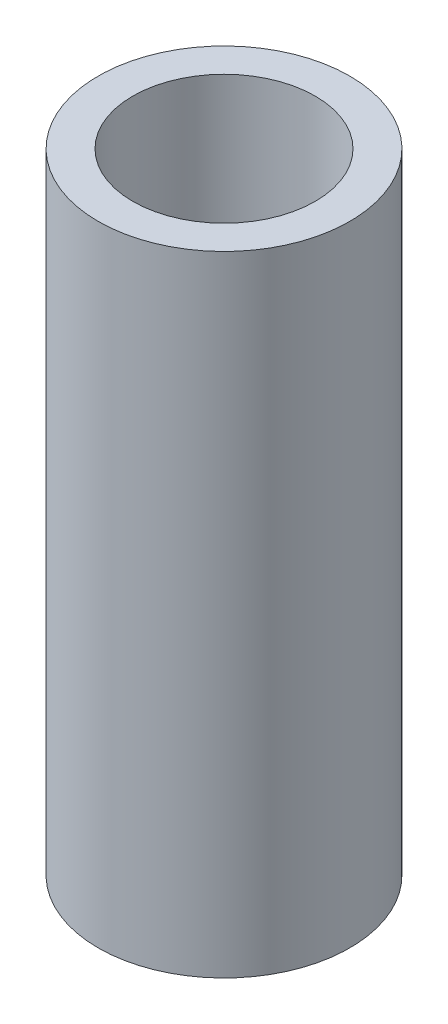
ISO-10303-21;
HEADER;
FILE_DESCRIPTION(('STEP AP214'),'2;1');
FILE_NAME('part.step','',(''),(''),'','','');
FILE_SCHEMA(('AUTOMOTIVE_DESIGN { 1 0 10303 214 1 1 1 1 }'));
ENDSEC;
DATA;
#1=APPLICATION_CONTEXT('core data for automotive mechanical design processes');
#2=APPLICATION_PROTOCOL_DEFINITION('international standard','automotive_design',2000,#1);
#3=PRODUCT_CONTEXT('',#1,'mechanical');
#4=PRODUCT('Part','Part','',(#3));
#5=PRODUCT_RELATED_PRODUCT_CATEGORY('part','',(#4));
#6=PRODUCT_DEFINITION_FORMATION('','',#4);
#7=PRODUCT_DEFINITION_CONTEXT('part definition',#1,'design');
#8=PRODUCT_DEFINITION('design','',#6,#7);
#9=PRODUCT_DEFINITION_SHAPE('','',#8);
#10=(LENGTH_UNIT() NAMED_UNIT(*) SI_UNIT(.MILLI.,.METRE.));
#11=(NAMED_UNIT(*) PLANE_ANGLE_UNIT() SI_UNIT($,.RADIAN.));
#12=(NAMED_UNIT(*) SI_UNIT($,.STERADIAN.) SOLID_ANGLE_UNIT());
#13=UNCERTAINTY_MEASURE_WITH_UNIT(LENGTH_MEASURE(1.E-05),#10,'distance_accuracy_value','');
#14=(GEOMETRIC_REPRESENTATION_CONTEXT(3) GLOBAL_UNCERTAINTY_ASSIGNED_CONTEXT((#13)) GLOBAL_UNIT_ASSIGNED_CONTEXT((#10,
#11,#12)) REPRESENTATION_CONTEXT('',''));
#15=CARTESIAN_POINT('',(0.,0.,0.));
#16=DIRECTION('',(0.,0.,1.));
#17=DIRECTION('',(1.,0.,0.));
#18=AXIS2_PLACEMENT_3D('',#15,#16,#17);
#19=CARTESIAN_POINT('',(0.,10.,0.));
#20=DIRECTION('',(0.,1.,0.));
#21=DIRECTION('',(0.,0.,1.));
#22=AXIS2_PLACEMENT_3D('',#19,#20,#21);
#23=PLANE('',#22);
#24=CARTESIAN_POINT('',(0.,10.,0.));
#25=DIRECTION('',(0.,1.,0.));
#26=DIRECTION('',(0.,0.,1.));
#27=AXIS2_PLACEMENT_3D('',#24,#25,#26);
#28=CIRCLE('',#27,2.);
#29=CARTESIAN_POINT('',(0.,10.,2.));
#30=VERTEX_POINT('',#29);
#31=EDGE_CURVE('E10',#30,#30,#28,.T.);
#32=ORIENTED_EDGE('',*,*,#31,.T.);
#33=EDGE_LOOP('',(#32));
#34=FACE_BOUND('',#33,.T.);
#35=CARTESIAN_POINT('',(0.,10.,0.));
#36=DIRECTION('',(0.,1.,0.));
#37=DIRECTION('',(0.,0.,1.));
#38=AXIS2_PLACEMENT_3D('',#35,#36,#37);
#39=CIRCLE('',#38,1.45);
#40=CARTESIAN_POINT('',(0.,10.,1.45));
#41=VERTEX_POINT('',#40);
#42=EDGE_CURVE('E56',#41,#41,#39,.T.);
#43=ORIENTED_EDGE('',*,*,#42,.F.);
#44=EDGE_LOOP('',(#43));
#45=FACE_BOUND('',#44,.T.);
#46=ADVANCED_FACE('F43',(#34,#45),#23,.T.);
#47=CARTESIAN_POINT('',(0.,0.,0.));
#48=DIRECTION('',(0.,1.,0.));
#49=DIRECTION('',(0.,0.,1.));
#50=AXIS2_PLACEMENT_3D('',#47,#48,#49);
#51=PLANE('',#50);
#52=CARTESIAN_POINT('',(0.,0.,0.));
#53=DIRECTION('',(0.,1.,0.));
#54=DIRECTION('',(0.,0.,1.));
#55=AXIS2_PLACEMENT_3D('',#52,#53,#54);
#56=CIRCLE('',#55,2.);
#57=CARTESIAN_POINT('',(0.,0.,2.));
#58=VERTEX_POINT('',#57);
#59=EDGE_CURVE('E47',#58,#58,#56,.T.);
#60=ORIENTED_EDGE('',*,*,#59,.F.);
#61=EDGE_LOOP('',(#60));
#62=FACE_BOUND('',#61,.T.);
#63=CARTESIAN_POINT('',(0.,0.,0.));
#64=DIRECTION('',(0.,1.,0.));
#65=DIRECTION('',(0.,0.,1.));
#66=AXIS2_PLACEMENT_3D('',#63,#64,#65);
#67=CIRCLE('',#66,1.45);
#68=CARTESIAN_POINT('',(0.,0.,1.45));
#69=VERTEX_POINT('',#68);
#70=EDGE_CURVE('E58',#69,#69,#67,.T.);
#71=ORIENTED_EDGE('',*,*,#70,.T.);
#72=EDGE_LOOP('',(#71));
#73=FACE_BOUND('',#72,.T.);
#74=ADVANCED_FACE('F70',(#62,#73),#51,.F.);
#75=CARTESIAN_POINT('',(0.,10.,0.));
#76=DIRECTION('',(0.,-1.,0.));
#77=DIRECTION('',(0.,0.,-1.));
#78=AXIS2_PLACEMENT_3D('',#75,#76,#77);
#79=CYLINDRICAL_SURFACE('',#78,2.);
#80=ORIENTED_EDGE('',*,*,#31,.F.);
#81=EDGE_LOOP('',(#80));
#82=FACE_BOUND('',#81,.T.);
#83=ORIENTED_EDGE('',*,*,#59,.T.);
#84=EDGE_LOOP('',(#83));
#85=FACE_BOUND('',#84,.T.);
#86=ADVANCED_FACE('F45',(#82,#85),#79,.T.);
#87=CARTESIAN_POINT('',(0.,10.,0.));
#88=DIRECTION('',(0.,-1.,0.));
#89=DIRECTION('',(0.,0.,-1.));
#90=AXIS2_PLACEMENT_3D('',#87,#88,#89);
#91=CYLINDRICAL_SURFACE('',#90,1.45);
#92=ORIENTED_EDGE('',*,*,#42,.T.);
#93=EDGE_LOOP('',(#92));
#94=FACE_BOUND('',#93,.T.);
#95=ORIENTED_EDGE('',*,*,#70,.F.);
#96=EDGE_LOOP('',(#95));
#97=FACE_BOUND('',#96,.T.);
#98=ADVANCED_FACE('F66',(#94,#97),#91,.F.);
#99=CLOSED_SHELL('',(#46,#74,#86,#98));
#100=MANIFOLD_SOLID_BREP('B2',#99);
#101=ADVANCED_BREP_SHAPE_REPRESENTATION('',(#18,#100),#14);
#102=SHAPE_DEFINITION_REPRESENTATION(#9,#101);
ENDSEC;
END-ISO-10303-21;
